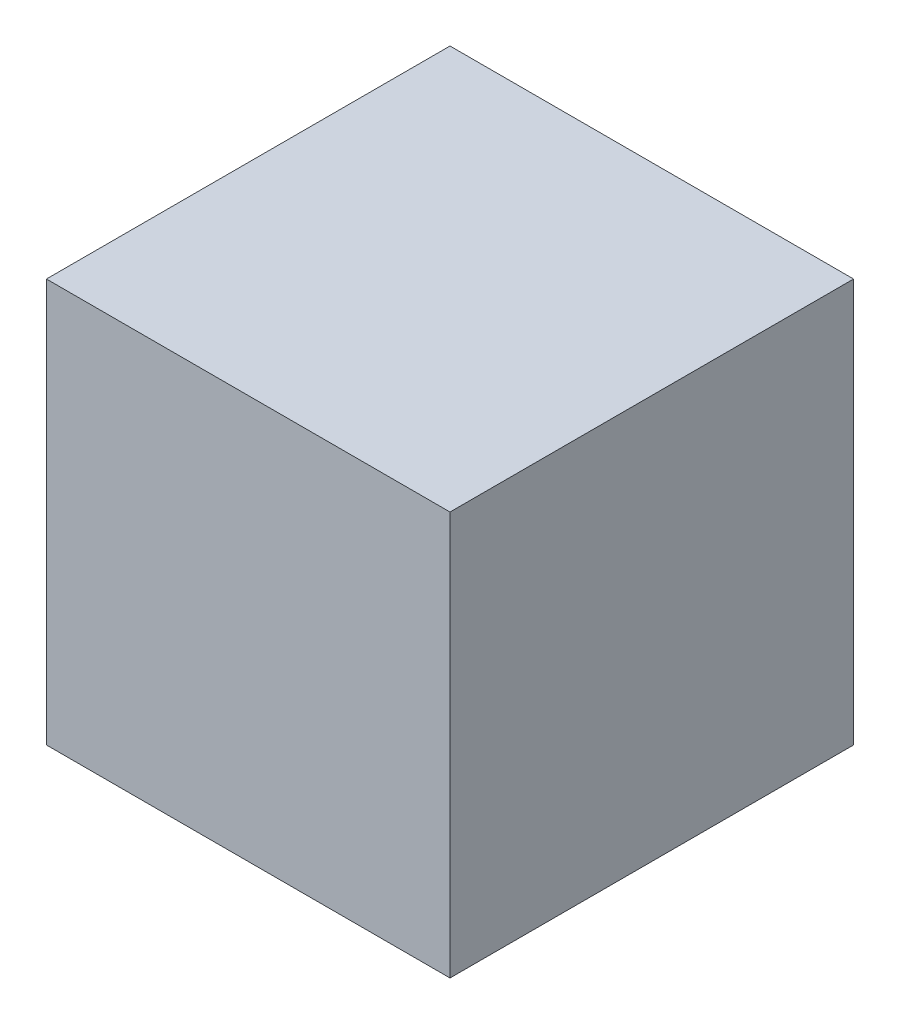
ISO-10303-21;
HEADER;
FILE_DESCRIPTION(('STEP AP214'),'2;1');
FILE_NAME('part.step','',(''),(''),'','','');
FILE_SCHEMA(('AUTOMOTIVE_DESIGN { 1 0 10303 214 1 1 1 1 }'));
ENDSEC;
DATA;
#1=APPLICATION_CONTEXT('core data for automotive mechanical design processes');
#2=APPLICATION_PROTOCOL_DEFINITION('international standard','automotive_design',2000,#1);
#3=PRODUCT_CONTEXT('',#1,'mechanical');
#4=PRODUCT('Part','Part','',(#3));
#5=PRODUCT_RELATED_PRODUCT_CATEGORY('part','',(#4));
#6=PRODUCT_DEFINITION_FORMATION('','',#4);
#7=PRODUCT_DEFINITION_CONTEXT('part definition',#1,'design');
#8=PRODUCT_DEFINITION('design','',#6,#7);
#9=PRODUCT_DEFINITION_SHAPE('','',#8);
#10=(LENGTH_UNIT() NAMED_UNIT(*) SI_UNIT(.MILLI.,.METRE.));
#11=(NAMED_UNIT(*) PLANE_ANGLE_UNIT() SI_UNIT($,.RADIAN.));
#12=(NAMED_UNIT(*) SI_UNIT($,.STERADIAN.) SOLID_ANGLE_UNIT());
#13=UNCERTAINTY_MEASURE_WITH_UNIT(LENGTH_MEASURE(1.E-05),#10,'distance_accuracy_value','');
#14=(GEOMETRIC_REPRESENTATION_CONTEXT(3) GLOBAL_UNCERTAINTY_ASSIGNED_CONTEXT((#13)) GLOBAL_UNIT_ASSIGNED_CONTEXT((#10,
#11,#12)) REPRESENTATION_CONTEXT('',''));
#15=CARTESIAN_POINT('',(0.,0.,0.));
#16=DIRECTION('',(0.,0.,1.));
#17=DIRECTION('',(1.,0.,0.));
#18=AXIS2_PLACEMENT_3D('',#15,#16,#17);
#19=CARTESIAN_POINT('',(0.,14.,0.));
#20=DIRECTION('',(1.,0.,0.));
#21=DIRECTION('',(0.,0.,-1.));
#22=AXIS2_PLACEMENT_3D('',#19,#20,#21);
#23=PLANE('',#22);
#24=DIRECTION('',(0.,0.,1.));
#25=VECTOR('',#24,1.);
#26=CARTESIAN_POINT('',(0.,0.,0.));
#27=LINE('',#26,#25);
#28=CARTESIAN_POINT('',(0.,0.,0.));
#29=VERTEX_POINT('',#28);
#30=CARTESIAN_POINT('',(0.,0.,14.));
#31=VERTEX_POINT('',#30);
#32=EDGE_CURVE('E98',#29,#31,#27,.T.);
#33=ORIENTED_EDGE('',*,*,#32,.T.);
#34=DIRECTION('',(0.,-1.,0.));
#35=VECTOR('',#34,1.);
#36=CARTESIAN_POINT('',(0.,14.,14.));
#37=LINE('',#36,#35);
#38=CARTESIAN_POINT('',(0.,14.,14.));
#39=VERTEX_POINT('',#38);
#40=EDGE_CURVE('E11',#39,#31,#37,.T.);
#41=ORIENTED_EDGE('',*,*,#40,.F.);
#42=DIRECTION('',(0.,0.,1.));
#43=VECTOR('',#42,1.);
#44=CARTESIAN_POINT('',(0.,14.,0.));
#45=LINE('',#44,#43);
#46=CARTESIAN_POINT('',(0.,14.,0.));
#47=VERTEX_POINT('',#46);
#48=EDGE_CURVE('E86',#47,#39,#45,.T.);
#49=ORIENTED_EDGE('',*,*,#48,.F.);
#50=DIRECTION('',(0.,-1.,0.));
#51=VECTOR('',#50,1.);
#52=CARTESIAN_POINT('',(0.,14.,0.));
#53=LINE('',#52,#51);
#54=EDGE_CURVE('E94',#47,#29,#53,.T.);
#55=ORIENTED_EDGE('',*,*,#54,.T.);
#56=EDGE_LOOP('',(#33,#41,#49,#55));
#57=FACE_BOUND('',#56,.T.);
#58=ADVANCED_FACE('F35',(#57),#23,.F.);
#59=CARTESIAN_POINT('',(0.,14.,14.));
#60=DIRECTION('',(0.,0.,-1.));
#61=DIRECTION('',(-1.,0.,0.));
#62=AXIS2_PLACEMENT_3D('',#59,#60,#61);
#63=PLANE('',#62);
#64=DIRECTION('',(1.,0.,0.));
#65=VECTOR('',#64,1.);
#66=CARTESIAN_POINT('',(0.,0.,14.));
#67=LINE('',#66,#65);
#68=CARTESIAN_POINT('',(14.,0.,14.));
#69=VERTEX_POINT('',#68);
#70=EDGE_CURVE('E90',#31,#69,#67,.T.);
#71=ORIENTED_EDGE('',*,*,#70,.T.);
#72=DIRECTION('',(0.,-1.,0.));
#73=VECTOR('',#72,1.);
#74=CARTESIAN_POINT('',(14.,14.,14.));
#75=LINE('',#74,#73);
#76=CARTESIAN_POINT('',(14.,14.,14.));
#77=VERTEX_POINT('',#76);
#78=EDGE_CURVE('E43',#77,#69,#75,.T.);
#79=ORIENTED_EDGE('',*,*,#78,.F.);
#80=DIRECTION('',(1.,0.,0.));
#81=VECTOR('',#80,1.);
#82=CARTESIAN_POINT('',(0.,14.,14.));
#83=LINE('',#82,#81);
#84=EDGE_CURVE('E81',#39,#77,#83,.T.);
#85=ORIENTED_EDGE('',*,*,#84,.F.);
#86=ORIENTED_EDGE('',*,*,#40,.T.);
#87=EDGE_LOOP('',(#71,#79,#85,#86));
#88=FACE_BOUND('',#87,.T.);
#89=ADVANCED_FACE('F89',(#88),#63,.F.);
#90=CARTESIAN_POINT('',(14.,14.,0.));
#91=DIRECTION('',(-1.,0.,0.));
#92=DIRECTION('',(0.,0.,1.));
#93=AXIS2_PLACEMENT_3D('',#90,#91,#92);
#94=PLANE('',#93);
#95=DIRECTION('',(0.,0.,-1.));
#96=VECTOR('',#95,1.);
#97=CARTESIAN_POINT('',(14.,0.,0.));
#98=LINE('',#97,#96);
#99=CARTESIAN_POINT('',(14.,0.,0.));
#100=VERTEX_POINT('',#99);
#101=EDGE_CURVE('E68',#69,#100,#98,.T.);
#102=ORIENTED_EDGE('',*,*,#101,.T.);
#103=DIRECTION('',(0.,-1.,0.));
#104=VECTOR('',#103,1.);
#105=CARTESIAN_POINT('',(14.,14.,0.));
#106=LINE('',#105,#104);
#107=CARTESIAN_POINT('',(14.,14.,0.));
#108=VERTEX_POINT('',#107);
#109=EDGE_CURVE('E91',#108,#100,#106,.T.);
#110=ORIENTED_EDGE('',*,*,#109,.F.);
#111=DIRECTION('',(0.,0.,-1.));
#112=VECTOR('',#111,1.);
#113=CARTESIAN_POINT('',(14.,14.,0.));
#114=LINE('',#113,#112);
#115=EDGE_CURVE('E84',#77,#108,#114,.T.);
#116=ORIENTED_EDGE('',*,*,#115,.F.);
#117=ORIENTED_EDGE('',*,*,#78,.T.);
#118=EDGE_LOOP('',(#102,#110,#116,#117));
#119=FACE_BOUND('',#118,.T.);
#120=ADVANCED_FACE('F92',(#119),#94,.F.);
#121=CARTESIAN_POINT('',(0.,14.,0.));
#122=DIRECTION('',(0.,0.,1.));
#123=DIRECTION('',(1.,0.,0.));
#124=AXIS2_PLACEMENT_3D('',#121,#122,#123);
#125=PLANE('',#124);
#126=DIRECTION('',(-1.,0.,0.));
#127=VECTOR('',#126,1.);
#128=CARTESIAN_POINT('',(0.,0.,0.));
#129=LINE('',#128,#127);
#130=EDGE_CURVE('E74',#100,#29,#129,.T.);
#131=ORIENTED_EDGE('',*,*,#130,.T.);
#132=ORIENTED_EDGE('',*,*,#54,.F.);
#133=DIRECTION('',(-1.,0.,0.));
#134=VECTOR('',#133,1.);
#135=CARTESIAN_POINT('',(0.,14.,0.));
#136=LINE('',#135,#134);
#137=EDGE_CURVE('E51',#108,#47,#136,.T.);
#138=ORIENTED_EDGE('',*,*,#137,.F.);
#139=ORIENTED_EDGE('',*,*,#109,.T.);
#140=EDGE_LOOP('',(#131,#132,#138,#139));
#141=FACE_BOUND('',#140,.T.);
#142=ADVANCED_FACE('F105',(#141),#125,.F.);
#143=CARTESIAN_POINT('',(0.,14.,0.));
#144=DIRECTION('',(0.,1.,0.));
#145=DIRECTION('',(0.,0.,1.));
#146=AXIS2_PLACEMENT_3D('',#143,#144,#145);
#147=PLANE('',#146);
#148=ORIENTED_EDGE('',*,*,#48,.T.);
#149=ORIENTED_EDGE('',*,*,#84,.T.);
#150=ORIENTED_EDGE('',*,*,#115,.T.);
#151=ORIENTED_EDGE('',*,*,#137,.T.);
#152=EDGE_LOOP('',(#148,#149,#150,#151));
#153=FACE_BOUND('',#152,.T.);
#154=ADVANCED_FACE('F82',(#153),#147,.T.);
#155=CARTESIAN_POINT('',(0.,0.,0.));
#156=DIRECTION('',(0.,1.,0.));
#157=DIRECTION('',(0.,0.,1.));
#158=AXIS2_PLACEMENT_3D('',#155,#156,#157);
#159=PLANE('',#158);
#160=ORIENTED_EDGE('',*,*,#32,.F.);
#161=ORIENTED_EDGE('',*,*,#130,.F.);
#162=ORIENTED_EDGE('',*,*,#101,.F.);
#163=ORIENTED_EDGE('',*,*,#70,.F.);
#164=EDGE_LOOP('',(#160,#161,#162,#163));
#165=FACE_BOUND('',#164,.T.);
#166=ADVANCED_FACE('F108',(#165),#159,.F.);
#167=CLOSED_SHELL('',(#58,#89,#120,#142,#154,#166));
#168=MANIFOLD_SOLID_BREP('B2',#167);
#169=ADVANCED_BREP_SHAPE_REPRESENTATION('',(#18,#168),#14);
#170=SHAPE_DEFINITION_REPRESENTATION(#9,#169);
ENDSEC;
END-ISO-10303-21;
